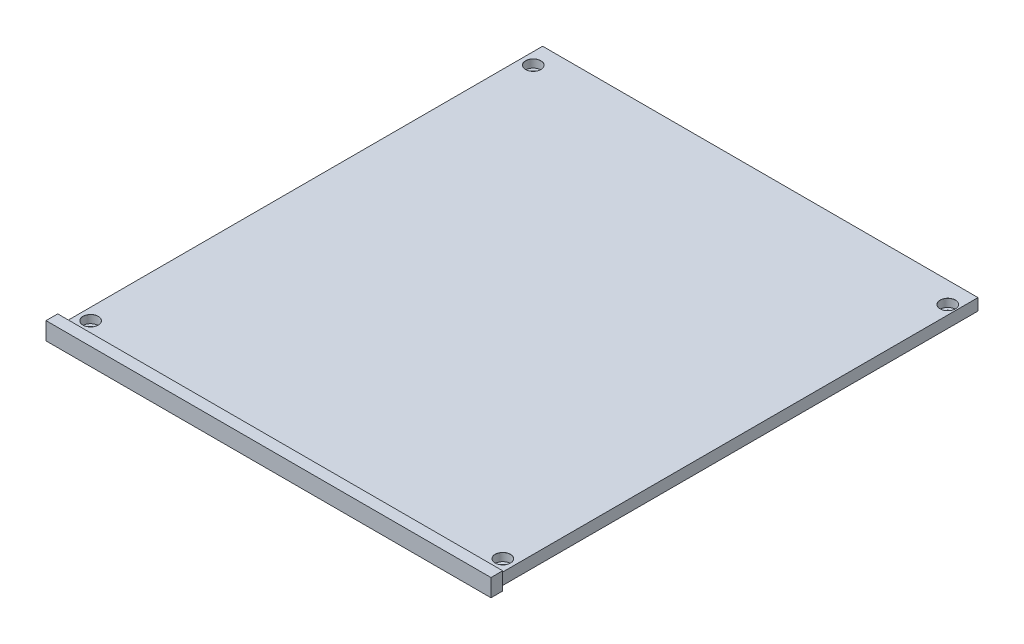
ISO-10303-21;
HEADER;
FILE_DESCRIPTION(('STEP AP214'),'2;1');
FILE_NAME('part.step','',(''),(''),'','','');
FILE_SCHEMA(('AUTOMOTIVE_DESIGN { 1 0 10303 214 1 1 1 1 }'));
ENDSEC;
DATA;
#1=APPLICATION_CONTEXT('core data for automotive mechanical design processes');
#2=APPLICATION_PROTOCOL_DEFINITION('international standard','automotive_design',2000,#1);
#3=PRODUCT_CONTEXT('',#1,'mechanical');
#4=PRODUCT('Part','Part','',(#3));
#5=PRODUCT_RELATED_PRODUCT_CATEGORY('part','',(#4));
#6=PRODUCT_DEFINITION_FORMATION('','',#4);
#7=PRODUCT_DEFINITION_CONTEXT('part definition',#1,'design');
#8=PRODUCT_DEFINITION('design','',#6,#7);
#9=PRODUCT_DEFINITION_SHAPE('','',#8);
#10=(LENGTH_UNIT() NAMED_UNIT(*) SI_UNIT(.MILLI.,.METRE.));
#11=(NAMED_UNIT(*) PLANE_ANGLE_UNIT() SI_UNIT($,.RADIAN.));
#12=(NAMED_UNIT(*) SI_UNIT($,.STERADIAN.) SOLID_ANGLE_UNIT());
#13=UNCERTAINTY_MEASURE_WITH_UNIT(LENGTH_MEASURE(1.E-05),#10,'distance_accuracy_value','');
#14=(GEOMETRIC_REPRESENTATION_CONTEXT(3) GLOBAL_UNCERTAINTY_ASSIGNED_CONTEXT((#13)) GLOBAL_UNIT_ASSIGNED_CONTEXT((#10,
#11,#12)) REPRESENTATION_CONTEXT('',''));
#15=CARTESIAN_POINT('',(0.,0.,0.));
#16=DIRECTION('',(0.,0.,1.));
#17=DIRECTION('',(1.,0.,0.));
#18=AXIS2_PLACEMENT_3D('',#15,#16,#17);
#19=CARTESIAN_POINT('',(0.,0.,0.));
#20=DIRECTION('',(0.,0.,1.));
#21=DIRECTION('',(1.,0.,0.));
#22=AXIS2_PLACEMENT_3D('',#19,#20,#21);
#23=PLANE('',#22);
#24=DIRECTION('',(0.,1.,0.));
#25=VECTOR('',#24,1.);
#26=CARTESIAN_POINT('',(95.,5.,0.));
#27=LINE('',#26,#25);
#28=CARTESIAN_POINT('',(95.,-2.495,0.));
#29=VERTEX_POINT('',#28);
#30=CARTESIAN_POINT('',(95.,5.,0.));
#31=VERTEX_POINT('',#30);
#32=EDGE_CURVE('E144',#29,#31,#27,.T.);
#33=ORIENTED_EDGE('',*,*,#32,.F.);
#34=DIRECTION('',(1.,0.,0.));
#35=VECTOR('',#34,1.);
#36=CARTESIAN_POINT('',(95.,-2.495,0.));
#37=LINE('',#36,#35);
#38=CARTESIAN_POINT('',(92.95,-2.495,0.));
#39=VERTEX_POINT('',#38);
#40=EDGE_CURVE('E130',#39,#29,#37,.T.);
#41=ORIENTED_EDGE('',*,*,#40,.F.);
#42=DIRECTION('',(0.,-1.,0.));
#43=VECTOR('',#42,1.);
#44=CARTESIAN_POINT('',(92.95,2.495,0.));
#45=LINE('',#44,#43);
#46=CARTESIAN_POINT('',(92.95,2.495,0.));
#47=VERTEX_POINT('',#46);
#48=EDGE_CURVE('E236',#47,#39,#45,.T.);
#49=ORIENTED_EDGE('',*,*,#48,.F.);
#50=DIRECTION('',(1.,0.,0.));
#51=VECTOR('',#50,1.);
#52=CARTESIAN_POINT('',(92.95,2.495,0.));
#53=LINE('',#52,#51);
#54=CARTESIAN_POINT('',(-92.95,2.495,0.));
#55=VERTEX_POINT('',#54);
#56=EDGE_CURVE('E70',#55,#47,#53,.T.);
#57=ORIENTED_EDGE('',*,*,#56,.F.);
#58=DIRECTION('',(0.,1.,0.));
#59=VECTOR('',#58,1.);
#60=CARTESIAN_POINT('',(-92.95,2.495,0.));
#61=LINE('',#60,#59);
#62=CARTESIAN_POINT('',(-92.95,-2.495,0.));
#63=VERTEX_POINT('',#62);
#64=EDGE_CURVE('E127',#63,#55,#61,.T.);
#65=ORIENTED_EDGE('',*,*,#64,.F.);
#66=CARTESIAN_POINT('',(-95.,-2.495,0.));
#67=VERTEX_POINT('',#66);
#68=EDGE_CURVE('E63',#67,#63,#37,.T.);
#69=ORIENTED_EDGE('',*,*,#68,.F.);
#70=DIRECTION('',(0.,-1.,0.));
#71=VECTOR('',#70,1.);
#72=CARTESIAN_POINT('',(-95.,5.,0.));
#73=LINE('',#72,#71);
#74=CARTESIAN_POINT('',(-95.,5.,0.));
#75=VERTEX_POINT('',#74);
#76=EDGE_CURVE('E125',#75,#67,#73,.T.);
#77=ORIENTED_EDGE('',*,*,#76,.F.);
#78=DIRECTION('',(-1.,0.,0.));
#79=VECTOR('',#78,1.);
#80=CARTESIAN_POINT('',(-95.,5.,0.));
#81=LINE('',#80,#79);
#82=EDGE_CURVE('E138',#31,#75,#81,.T.);
#83=ORIENTED_EDGE('',*,*,#82,.F.);
#84=EDGE_LOOP('',(#33,#41,#49,#57,#65,#69,#77,#83));
#85=FACE_BOUND('',#84,.T.);
#86=ADVANCED_FACE('F47',(#85),#23,.F.);
#87=CARTESIAN_POINT('',(95.,5.,5.));
#88=DIRECTION('',(-1.,0.,0.));
#89=DIRECTION('',(0.,0.,1.));
#90=AXIS2_PLACEMENT_3D('',#87,#88,#89);
#91=PLANE('',#90);
#92=DIRECTION('',(0.,1.,0.));
#93=VECTOR('',#92,1.);
#94=CARTESIAN_POINT('',(95.,5.,5.));
#95=LINE('',#94,#93);
#96=CARTESIAN_POINT('',(95.,-2.495,5.));
#97=VERTEX_POINT('',#96);
#98=CARTESIAN_POINT('',(95.,5.,5.));
#99=VERTEX_POINT('',#98);
#100=EDGE_CURVE('E137',#97,#99,#95,.T.);
#101=ORIENTED_EDGE('',*,*,#100,.F.);
#102=DIRECTION('',(0.,0.,-1.));
#103=VECTOR('',#102,1.);
#104=CARTESIAN_POINT('',(95.,-2.495,10.));
#105=LINE('',#104,#103);
#106=EDGE_CURVE('E120',#97,#29,#105,.T.);
#107=ORIENTED_EDGE('',*,*,#106,.T.);
#108=ORIENTED_EDGE('',*,*,#32,.T.);
#109=DIRECTION('',(0.,0.,-1.));
#110=VECTOR('',#109,1.);
#111=CARTESIAN_POINT('',(95.,5.,5.));
#112=LINE('',#111,#110);
#113=EDGE_CURVE('E56',#99,#31,#112,.T.);
#114=ORIENTED_EDGE('',*,*,#113,.F.);
#115=EDGE_LOOP('',(#101,#107,#108,#114));
#116=FACE_BOUND('',#115,.T.);
#117=ADVANCED_FACE('F49',(#116),#91,.F.);
#118=CARTESIAN_POINT('',(-95.,5.,5.));
#119=DIRECTION('',(0.,-1.,0.));
#120=DIRECTION('',(0.,0.,-1.));
#121=AXIS2_PLACEMENT_3D('',#118,#119,#120);
#122=PLANE('',#121);
#123=ORIENTED_EDGE('',*,*,#82,.T.);
#124=DIRECTION('',(0.,0.,-1.));
#125=VECTOR('',#124,1.);
#126=CARTESIAN_POINT('',(-95.,5.,5.));
#127=LINE('',#126,#125);
#128=CARTESIAN_POINT('',(-95.,5.,5.));
#129=VERTEX_POINT('',#128);
#130=EDGE_CURVE('E135',#129,#75,#127,.T.);
#131=ORIENTED_EDGE('',*,*,#130,.F.);
#132=DIRECTION('',(-1.,0.,0.));
#133=VECTOR('',#132,1.);
#134=CARTESIAN_POINT('',(-95.,5.,5.));
#135=LINE('',#134,#133);
#136=EDGE_CURVE('E142',#99,#129,#135,.T.);
#137=ORIENTED_EDGE('',*,*,#136,.F.);
#138=ORIENTED_EDGE('',*,*,#113,.T.);
#139=EDGE_LOOP('',(#123,#131,#137,#138));
#140=FACE_BOUND('',#139,.T.);
#141=ADVANCED_FACE('F275',(#140),#122,.F.);
#142=CARTESIAN_POINT('',(-95.,5.,5.));
#143=DIRECTION('',(1.,0.,0.));
#144=DIRECTION('',(0.,0.,-1.));
#145=AXIS2_PLACEMENT_3D('',#142,#143,#144);
#146=PLANE('',#145);
#147=ORIENTED_EDGE('',*,*,#76,.T.);
#148=DIRECTION('',(0.,0.,-1.));
#149=VECTOR('',#148,1.);
#150=CARTESIAN_POINT('',(-95.,-2.495,10.));
#151=LINE('',#150,#149);
#152=CARTESIAN_POINT('',(-95.,-2.495,5.));
#153=VERTEX_POINT('',#152);
#154=EDGE_CURVE('E111',#153,#67,#151,.T.);
#155=ORIENTED_EDGE('',*,*,#154,.F.);
#156=DIRECTION('',(0.,-1.,0.));
#157=VECTOR('',#156,1.);
#158=CARTESIAN_POINT('',(-95.,5.,5.));
#159=LINE('',#158,#157);
#160=EDGE_CURVE('E150',#129,#153,#159,.T.);
#161=ORIENTED_EDGE('',*,*,#160,.F.);
#162=ORIENTED_EDGE('',*,*,#130,.T.);
#163=EDGE_LOOP('',(#147,#155,#161,#162));
#164=FACE_BOUND('',#163,.T.);
#165=ADVANCED_FACE('F133',(#164),#146,.F.);
#166=CARTESIAN_POINT('',(0.,0.,5.));
#167=DIRECTION('',(0.,0.,1.));
#168=DIRECTION('',(1.,0.,0.));
#169=AXIS2_PLACEMENT_3D('',#166,#167,#168);
#170=PLANE('',#169);
#171=DIRECTION('',(-1.,0.,0.));
#172=VECTOR('',#171,1.);
#173=CARTESIAN_POINT('',(0.,-2.495,5.));
#174=LINE('',#173,#172);
#175=EDGE_CURVE('E11',#97,#153,#174,.T.);
#176=ORIENTED_EDGE('',*,*,#175,.F.);
#177=ORIENTED_EDGE('',*,*,#100,.T.);
#178=ORIENTED_EDGE('',*,*,#136,.T.);
#179=ORIENTED_EDGE('',*,*,#160,.T.);
#180=EDGE_LOOP('',(#176,#177,#178,#179));
#181=FACE_BOUND('',#180,.T.);
#182=ADVANCED_FACE('F277',(#181),#170,.T.);
#183=CARTESIAN_POINT('',(-92.95,2.495,-205.));
#184=DIRECTION('',(1.,0.,0.));
#185=DIRECTION('',(0.,0.,-1.));
#186=AXIS2_PLACEMENT_3D('',#183,#184,#185);
#187=PLANE('',#186);
#188=ORIENTED_EDGE('',*,*,#64,.T.);
#189=DIRECTION('',(0.,0.,1.));
#190=VECTOR('',#189,1.);
#191=CARTESIAN_POINT('',(-92.95,2.495,-205.));
#192=LINE('',#191,#190);
#193=CARTESIAN_POINT('',(-92.95,2.495,-205.));
#194=VERTEX_POINT('',#193);
#195=EDGE_CURVE('E262',#194,#55,#192,.T.);
#196=ORIENTED_EDGE('',*,*,#195,.F.);
#197=DIRECTION('',(0.,1.,0.));
#198=VECTOR('',#197,1.);
#199=CARTESIAN_POINT('',(-92.95,2.495,-205.));
#200=LINE('',#199,#198);
#201=CARTESIAN_POINT('',(-92.95,-2.495,-205.));
#202=VERTEX_POINT('',#201);
#203=EDGE_CURVE('E231',#202,#194,#200,.T.);
#204=ORIENTED_EDGE('',*,*,#203,.F.);
#205=DIRECTION('',(0.,0.,1.));
#206=VECTOR('',#205,1.);
#207=CARTESIAN_POINT('',(-92.95,-2.495,-205.));
#208=LINE('',#207,#206);
#209=EDGE_CURVE('E245',#202,#63,#208,.T.);
#210=ORIENTED_EDGE('',*,*,#209,.T.);
#211=EDGE_LOOP('',(#188,#196,#204,#210));
#212=FACE_BOUND('',#211,.T.);
#213=ADVANCED_FACE('F279',(#212),#187,.F.);
#214=CARTESIAN_POINT('',(92.95,2.495,-205.));
#215=DIRECTION('',(0.,-1.,0.));
#216=DIRECTION('',(0.,0.,-1.));
#217=AXIS2_PLACEMENT_3D('',#214,#215,#216);
#218=PLANE('',#217);
#219=CARTESIAN_POINT('',(-87.95,2.495,-6.9999999999999));
#220=DIRECTION('',(0.,1.,0.));
#221=DIRECTION('',(0.,0.,1.));
#222=AXIS2_PLACEMENT_3D('',#219,#220,#221);
#223=CIRCLE('',#222,3.275);
#224=CARTESIAN_POINT('',(-87.95,2.495,-3.72499999999989));
#225=VERTEX_POINT('',#224);
#226=EDGE_CURVE('E536',#225,#225,#223,.T.);
#227=ORIENTED_EDGE('',*,*,#226,.F.);
#228=EDGE_LOOP('',(#227));
#229=FACE_BOUND('',#228,.T.);
#230=CARTESIAN_POINT('',(88.05,2.495,-6.99999999999984));
#231=DIRECTION('',(0.,1.,0.));
#232=DIRECTION('',(0.,0.,1.));
#233=AXIS2_PLACEMENT_3D('',#230,#231,#232);
#234=CIRCLE('',#233,3.275);
#235=CARTESIAN_POINT('',(88.05,2.495,-3.72499999999984));
#236=VERTEX_POINT('',#235);
#237=EDGE_CURVE('E173',#236,#236,#234,.T.);
#238=ORIENTED_EDGE('',*,*,#237,.F.);
#239=EDGE_LOOP('',(#238));
#240=FACE_BOUND('',#239,.T.);
#241=CARTESIAN_POINT('',(89.0500000000005,2.495,-196.));
#242=DIRECTION('',(0.,1.,0.));
#243=DIRECTION('',(0.,0.,1.));
#244=AXIS2_PLACEMENT_3D('',#241,#242,#243);
#245=CIRCLE('',#244,3.275);
#246=CARTESIAN_POINT('',(89.0500000000005,2.495,-192.725));
#247=VERTEX_POINT('',#246);
#248=EDGE_CURVE('E168',#247,#247,#245,.T.);
#249=ORIENTED_EDGE('',*,*,#248,.F.);
#250=EDGE_LOOP('',(#249));
#251=FACE_BOUND('',#250,.T.);
#252=CARTESIAN_POINT('',(-87.9499999999999,2.495,-196.));
#253=DIRECTION('',(0.,1.,0.));
#254=DIRECTION('',(0.,0.,1.));
#255=AXIS2_PLACEMENT_3D('',#252,#253,#254);
#256=CIRCLE('',#255,3.275);
#257=CARTESIAN_POINT('',(-87.9499999999999,2.495,-192.725));
#258=VERTEX_POINT('',#257);
#259=EDGE_CURVE('E163',#258,#258,#256,.T.);
#260=ORIENTED_EDGE('',*,*,#259,.F.);
#261=EDGE_LOOP('',(#260));
#262=FACE_BOUND('',#261,.T.);
#263=ORIENTED_EDGE('',*,*,#56,.T.);
#264=DIRECTION('',(0.,0.,1.));
#265=VECTOR('',#264,1.);
#266=CARTESIAN_POINT('',(92.95,2.495,-205.));
#267=LINE('',#266,#265);
#268=CARTESIAN_POINT('',(92.95,2.495,-205.));
#269=VERTEX_POINT('',#268);
#270=EDGE_CURVE('E258',#269,#47,#267,.T.);
#271=ORIENTED_EDGE('',*,*,#270,.F.);
#272=DIRECTION('',(1.,0.,0.));
#273=VECTOR('',#272,1.);
#274=CARTESIAN_POINT('',(92.95,2.495,-205.));
#275=LINE('',#274,#273);
#276=EDGE_CURVE('E235',#194,#269,#275,.T.);
#277=ORIENTED_EDGE('',*,*,#276,.F.);
#278=ORIENTED_EDGE('',*,*,#195,.T.);
#279=EDGE_LOOP('',(#263,#271,#277,#278));
#280=FACE_BOUND('',#279,.T.);
#281=ADVANCED_FACE('F285',(#229,#240,#251,#262,#280),#218,.F.);
#282=CARTESIAN_POINT('',(92.95,2.495,-205.));
#283=DIRECTION('',(-1.,0.,0.));
#284=DIRECTION('',(0.,0.,1.));
#285=AXIS2_PLACEMENT_3D('',#282,#283,#284);
#286=PLANE('',#285);
#287=ORIENTED_EDGE('',*,*,#48,.T.);
#288=DIRECTION('',(0.,0.,1.));
#289=VECTOR('',#288,1.);
#290=CARTESIAN_POINT('',(92.95,-2.495,-205.));
#291=LINE('',#290,#289);
#292=CARTESIAN_POINT('',(92.95,-2.495,-205.));
#293=VERTEX_POINT('',#292);
#294=EDGE_CURVE('E255',#293,#39,#291,.T.);
#295=ORIENTED_EDGE('',*,*,#294,.F.);
#296=DIRECTION('',(0.,-1.,0.));
#297=VECTOR('',#296,1.);
#298=CARTESIAN_POINT('',(92.95,2.495,-205.));
#299=LINE('',#298,#297);
#300=EDGE_CURVE('E239',#269,#293,#299,.T.);
#301=ORIENTED_EDGE('',*,*,#300,.F.);
#302=ORIENTED_EDGE('',*,*,#270,.T.);
#303=EDGE_LOOP('',(#287,#295,#301,#302));
#304=FACE_BOUND('',#303,.T.);
#305=ADVANCED_FACE('F319',(#304),#286,.F.);
#306=CARTESIAN_POINT('',(92.95,-2.495,-205.));
#307=DIRECTION('',(0.,1.,0.));
#308=DIRECTION('',(0.,0.,1.));
#309=AXIS2_PLACEMENT_3D('',#306,#307,#308);
#310=PLANE('',#309);
#311=CARTESIAN_POINT('',(-87.95,-2.495,-6.9999999999999));
#312=DIRECTION('',(0.,1.,0.));
#313=DIRECTION('',(0.,0.,1.));
#314=AXIS2_PLACEMENT_3D('',#311,#312,#313);
#315=CIRCLE('',#314,1.8);
#316=CARTESIAN_POINT('',(-87.95,-2.495,-5.1999999999999));
#317=VERTEX_POINT('',#316);
#318=EDGE_CURVE('E170',#317,#317,#315,.T.);
#319=ORIENTED_EDGE('',*,*,#318,.T.);
#320=EDGE_LOOP('',(#319));
#321=FACE_BOUND('',#320,.T.);
#322=CARTESIAN_POINT('',(88.05,-2.495,-6.99999999999984));
#323=DIRECTION('',(0.,1.,0.));
#324=DIRECTION('',(0.,0.,1.));
#325=AXIS2_PLACEMENT_3D('',#322,#323,#324);
#326=CIRCLE('',#325,1.8);
#327=CARTESIAN_POINT('',(88.05,-2.495,-5.19999999999984));
#328=VERTEX_POINT('',#327);
#329=EDGE_CURVE('E165',#328,#328,#326,.T.);
#330=ORIENTED_EDGE('',*,*,#329,.T.);
#331=EDGE_LOOP('',(#330));
#332=FACE_BOUND('',#331,.T.);
#333=CARTESIAN_POINT('',(89.0500000000005,-2.495,-196.));
#334=DIRECTION('',(0.,1.,0.));
#335=DIRECTION('',(0.,0.,1.));
#336=AXIS2_PLACEMENT_3D('',#333,#334,#335);
#337=CIRCLE('',#336,1.8);
#338=CARTESIAN_POINT('',(89.0500000000005,-2.495,-194.2));
#339=VERTEX_POINT('',#338);
#340=EDGE_CURVE('E159',#339,#339,#337,.T.);
#341=ORIENTED_EDGE('',*,*,#340,.T.);
#342=EDGE_LOOP('',(#341));
#343=FACE_BOUND('',#342,.T.);
#344=CARTESIAN_POINT('',(-87.9499999999999,-2.495,-196.));
#345=DIRECTION('',(0.,1.,0.));
#346=DIRECTION('',(0.,0.,1.));
#347=AXIS2_PLACEMENT_3D('',#344,#345,#346);
#348=CIRCLE('',#347,1.8);
#349=CARTESIAN_POINT('',(-87.9499999999999,-2.495,-194.2));
#350=VERTEX_POINT('',#349);
#351=EDGE_CURVE('E154',#350,#350,#348,.T.);
#352=ORIENTED_EDGE('',*,*,#351,.T.);
#353=EDGE_LOOP('',(#352));
#354=FACE_BOUND('',#353,.T.);
#355=ORIENTED_EDGE('',*,*,#294,.T.);
#356=ORIENTED_EDGE('',*,*,#40,.T.);
#357=ORIENTED_EDGE('',*,*,#106,.F.);
#358=ORIENTED_EDGE('',*,*,#175,.T.);
#359=ORIENTED_EDGE('',*,*,#154,.T.);
#360=ORIENTED_EDGE('',*,*,#68,.T.);
#361=ORIENTED_EDGE('',*,*,#209,.F.);
#362=DIRECTION('',(-1.,0.,0.));
#363=VECTOR('',#362,1.);
#364=CARTESIAN_POINT('',(92.95,-2.495,-205.));
#365=LINE('',#364,#363);
#366=EDGE_CURVE('E242',#293,#202,#365,.T.);
#367=ORIENTED_EDGE('',*,*,#366,.F.);
#368=EDGE_LOOP('',(#355,#356,#357,#358,#359,#360,#361,#367));
#369=FACE_BOUND('',#368,.T.);
#370=ADVANCED_FACE('F113',(#321,#332,#343,#354,#369),#310,.F.);
#371=CARTESIAN_POINT('',(0.,0.,-205.));
#372=DIRECTION('',(0.,0.,-1.));
#373=DIRECTION('',(-1.,0.,0.));
#374=AXIS2_PLACEMENT_3D('',#371,#372,#373);
#375=PLANE('',#374);
#376=ORIENTED_EDGE('',*,*,#203,.T.);
#377=ORIENTED_EDGE('',*,*,#276,.T.);
#378=ORIENTED_EDGE('',*,*,#300,.T.);
#379=ORIENTED_EDGE('',*,*,#366,.T.);
#380=EDGE_LOOP('',(#376,#377,#378,#379));
#381=FACE_BOUND('',#380,.T.);
#382=ADVANCED_FACE('F304',(#381),#375,.T.);
#383=CARTESIAN_POINT('',(-87.9499999999999,2.495,-196.));
#384=DIRECTION('',(0.,1.,0.));
#385=DIRECTION('',(0.,0.,1.));
#386=AXIS2_PLACEMENT_3D('',#383,#384,#385);
#387=CYLINDRICAL_SURFACE('',#386,1.8);
#388=CARTESIAN_POINT('',(-87.9499999999999,-0.904999999999996,-196.));
#389=DIRECTION('',(0.,1.,0.));
#390=DIRECTION('',(0.,0.,1.));
#391=AXIS2_PLACEMENT_3D('',#388,#389,#390);
#392=CIRCLE('',#391,1.8);
#393=CARTESIAN_POINT('',(-87.9499999999999,-0.904999999999996,-194.2));
#394=VERTEX_POINT('',#393);
#395=EDGE_CURVE('E158',#394,#394,#392,.T.);
#396=ORIENTED_EDGE('',*,*,#395,.T.);
#397=EDGE_LOOP('',(#396));
#398=FACE_BOUND('',#397,.T.);
#399=ORIENTED_EDGE('',*,*,#351,.F.);
#400=EDGE_LOOP('',(#399));
#401=FACE_BOUND('',#400,.T.);
#402=ADVANCED_FACE('F308',(#398,#401),#387,.F.);
#403=CARTESIAN_POINT('',(-86.1499999999999,-0.904999999999996,-196.));
#404=DIRECTION('',(0.,-1.,0.));
#405=DIRECTION('',(0.,0.,-1.));
#406=AXIS2_PLACEMENT_3D('',#403,#404,#405);
#407=PLANE('',#406);
#408=ORIENTED_EDGE('',*,*,#395,.F.);
#409=EDGE_LOOP('',(#408));
#410=FACE_BOUND('',#409,.T.);
#411=CARTESIAN_POINT('',(-87.9499999999999,-0.904999999999996,-196.));
#412=DIRECTION('',(0.,1.,0.));
#413=DIRECTION('',(0.,0.,1.));
#414=AXIS2_PLACEMENT_3D('',#411,#412,#413);
#415=CIRCLE('',#414,3.24999999999999);
#416=CARTESIAN_POINT('',(-87.9499999999999,-0.904999999999996,-192.75));
#417=VERTEX_POINT('',#416);
#418=EDGE_CURVE('E224',#417,#417,#415,.T.);
#419=ORIENTED_EDGE('',*,*,#418,.T.);
#420=EDGE_LOOP('',(#419));
#421=FACE_BOUND('',#420,.T.);
#422=ADVANCED_FACE('F329',(#410,#421),#407,.F.);
#423=CARTESIAN_POINT('',(-87.9499999999999,2.495,-196.));
#424=DIRECTION('',(0.,1.,0.));
#425=DIRECTION('',(0.,0.,1.));
#426=AXIS2_PLACEMENT_3D('',#423,#424,#425);
#427=CYLINDRICAL_SURFACE('',#426,3.25);
#428=ORIENTED_EDGE('',*,*,#418,.F.);
#429=EDGE_LOOP('',(#428));
#430=FACE_BOUND('',#429,.T.);
#431=CARTESIAN_POINT('',(-87.9499999999999,2.47,-196.));
#432=DIRECTION('',(0.,1.,0.));
#433=DIRECTION('',(0.,0.,1.));
#434=AXIS2_PLACEMENT_3D('',#431,#432,#433);
#435=CIRCLE('',#434,3.25);
#436=CARTESIAN_POINT('',(-87.9499999999999,2.47,-192.75));
#437=VERTEX_POINT('',#436);
#438=EDGE_CURVE('E220',#437,#437,#435,.T.);
#439=ORIENTED_EDGE('',*,*,#438,.T.);
#440=EDGE_LOOP('',(#439));
#441=FACE_BOUND('',#440,.T.);
#442=ADVANCED_FACE('F338',(#430,#441),#427,.F.);
#443=CARTESIAN_POINT('',(-87.9499999999999,2.495,-196.));
#444=DIRECTION('',(0.,1.,0.));
#445=DIRECTION('',(0.,0.,1.));
#446=AXIS2_PLACEMENT_3D('',#443,#444,#445);
#447=CONICAL_SURFACE('',#446,3.275,0.785398163397318);
#448=ORIENTED_EDGE('',*,*,#438,.F.);
#449=EDGE_LOOP('',(#448));
#450=FACE_BOUND('',#449,.T.);
#451=ORIENTED_EDGE('',*,*,#259,.T.);
#452=EDGE_LOOP('',(#451));
#453=FACE_BOUND('',#452,.T.);
#454=ADVANCED_FACE('F347',(#450,#453),#447,.F.);
#455=CARTESIAN_POINT('',(89.0500000000005,2.495,-196.));
#456=DIRECTION('',(0.,1.,0.));
#457=DIRECTION('',(0.,0.,1.));
#458=AXIS2_PLACEMENT_3D('',#455,#456,#457);
#459=CYLINDRICAL_SURFACE('',#458,1.8);
#460=CARTESIAN_POINT('',(89.0500000000005,-0.904999999999996,-196.));
#461=DIRECTION('',(0.,1.,0.));
#462=DIRECTION('',(0.,0.,1.));
#463=AXIS2_PLACEMENT_3D('',#460,#461,#462);
#464=CIRCLE('',#463,1.8);
#465=CARTESIAN_POINT('',(89.0500000000005,-0.904999999999996,-194.2));
#466=VERTEX_POINT('',#465);
#467=EDGE_CURVE('E164',#466,#466,#464,.T.);
#468=ORIENTED_EDGE('',*,*,#467,.T.);
#469=EDGE_LOOP('',(#468));
#470=FACE_BOUND('',#469,.T.);
#471=ORIENTED_EDGE('',*,*,#340,.F.);
#472=EDGE_LOOP('',(#471));
#473=FACE_BOUND('',#472,.T.);
#474=ADVANCED_FACE('F356',(#470,#473),#459,.F.);
#475=CARTESIAN_POINT('',(90.8500000000004,-0.904999999999996,-196.));
#476=DIRECTION('',(0.,-1.,0.));
#477=DIRECTION('',(0.,0.,-1.));
#478=AXIS2_PLACEMENT_3D('',#475,#476,#477);
#479=PLANE('',#478);
#480=ORIENTED_EDGE('',*,*,#467,.F.);
#481=EDGE_LOOP('',(#480));
#482=FACE_BOUND('',#481,.T.);
#483=CARTESIAN_POINT('',(89.0500000000005,-0.904999999999996,-196.));
#484=DIRECTION('',(0.,1.,0.));
#485=DIRECTION('',(0.,0.,1.));
#486=AXIS2_PLACEMENT_3D('',#483,#484,#485);
#487=CIRCLE('',#486,3.24999999999999);
#488=CARTESIAN_POINT('',(89.0500000000005,-0.904999999999996,-192.75));
#489=VERTEX_POINT('',#488);
#490=EDGE_CURVE('E210',#489,#489,#487,.T.);
#491=ORIENTED_EDGE('',*,*,#490,.T.);
#492=EDGE_LOOP('',(#491));
#493=FACE_BOUND('',#492,.T.);
#494=ADVANCED_FACE('F365',(#482,#493),#479,.F.);
#495=CARTESIAN_POINT('',(89.0500000000005,2.495,-196.));
#496=DIRECTION('',(0.,1.,0.));
#497=DIRECTION('',(0.,0.,1.));
#498=AXIS2_PLACEMENT_3D('',#495,#496,#497);
#499=CYLINDRICAL_SURFACE('',#498,3.25);
#500=ORIENTED_EDGE('',*,*,#490,.F.);
#501=EDGE_LOOP('',(#500));
#502=FACE_BOUND('',#501,.T.);
#503=CARTESIAN_POINT('',(89.0500000000005,2.47,-196.));
#504=DIRECTION('',(0.,1.,0.));
#505=DIRECTION('',(0.,0.,1.));
#506=AXIS2_PLACEMENT_3D('',#503,#504,#505);
#507=CIRCLE('',#506,3.25);
#508=CARTESIAN_POINT('',(89.0500000000005,2.47,-192.75));
#509=VERTEX_POINT('',#508);
#510=EDGE_CURVE('E206',#509,#509,#507,.T.);
#511=ORIENTED_EDGE('',*,*,#510,.T.);
#512=EDGE_LOOP('',(#511));
#513=FACE_BOUND('',#512,.T.);
#514=ADVANCED_FACE('F374',(#502,#513),#499,.F.);
#515=CARTESIAN_POINT('',(89.0500000000005,2.495,-196.));
#516=DIRECTION('',(0.,1.,0.));
#517=DIRECTION('',(0.,0.,1.));
#518=AXIS2_PLACEMENT_3D('',#515,#516,#517);
#519=CONICAL_SURFACE('',#518,3.275,0.785398163397318);
#520=ORIENTED_EDGE('',*,*,#510,.F.);
#521=EDGE_LOOP('',(#520));
#522=FACE_BOUND('',#521,.T.);
#523=ORIENTED_EDGE('',*,*,#248,.T.);
#524=EDGE_LOOP('',(#523));
#525=FACE_BOUND('',#524,.T.);
#526=ADVANCED_FACE('F383',(#522,#525),#519,.F.);
#527=CARTESIAN_POINT('',(88.05,2.495,-6.99999999999984));
#528=DIRECTION('',(0.,1.,0.));
#529=DIRECTION('',(0.,0.,1.));
#530=AXIS2_PLACEMENT_3D('',#527,#528,#529);
#531=CYLINDRICAL_SURFACE('',#530,1.8);
#532=CARTESIAN_POINT('',(88.05,-0.904999999999996,-6.99999999999984));
#533=DIRECTION('',(0.,1.,0.));
#534=DIRECTION('',(0.,0.,1.));
#535=AXIS2_PLACEMENT_3D('',#532,#533,#534);
#536=CIRCLE('',#535,1.8);
#537=CARTESIAN_POINT('',(88.05,-0.904999999999996,-5.19999999999984));
#538=VERTEX_POINT('',#537);
#539=EDGE_CURVE('E169',#538,#538,#536,.T.);
#540=ORIENTED_EDGE('',*,*,#539,.T.);
#541=EDGE_LOOP('',(#540));
#542=FACE_BOUND('',#541,.T.);
#543=ORIENTED_EDGE('',*,*,#329,.F.);
#544=EDGE_LOOP('',(#543));
#545=FACE_BOUND('',#544,.T.);
#546=ADVANCED_FACE('F392',(#542,#545),#531,.F.);
#547=CARTESIAN_POINT('',(89.85,-0.904999999999996,-6.99999999999984));
#548=DIRECTION('',(0.,-1.,0.));
#549=DIRECTION('',(0.,0.,-1.));
#550=AXIS2_PLACEMENT_3D('',#547,#548,#549);
#551=PLANE('',#550);
#552=ORIENTED_EDGE('',*,*,#539,.F.);
#553=EDGE_LOOP('',(#552));
#554=FACE_BOUND('',#553,.T.);
#555=CARTESIAN_POINT('',(88.05,-0.904999999999996,-6.99999999999984));
#556=DIRECTION('',(0.,1.,0.));
#557=DIRECTION('',(0.,0.,1.));
#558=AXIS2_PLACEMENT_3D('',#555,#556,#557);
#559=CIRCLE('',#558,3.25);
#560=CARTESIAN_POINT('',(88.05,-0.904999999999996,-3.74999999999984));
#561=VERTEX_POINT('',#560);
#562=EDGE_CURVE('E196',#561,#561,#559,.T.);
#563=ORIENTED_EDGE('',*,*,#562,.T.);
#564=EDGE_LOOP('',(#563));
#565=FACE_BOUND('',#564,.T.);
#566=ADVANCED_FACE('F401',(#554,#565),#551,.F.);
#567=CARTESIAN_POINT('',(88.05,2.495,-6.99999999999984));
#568=DIRECTION('',(0.,1.,0.));
#569=DIRECTION('',(0.,0.,1.));
#570=AXIS2_PLACEMENT_3D('',#567,#568,#569);
#571=CYLINDRICAL_SURFACE('',#570,3.25);
#572=ORIENTED_EDGE('',*,*,#562,.F.);
#573=EDGE_LOOP('',(#572));
#574=FACE_BOUND('',#573,.T.);
#575=CARTESIAN_POINT('',(88.05,2.47,-6.99999999999984));
#576=DIRECTION('',(0.,1.,0.));
#577=DIRECTION('',(0.,0.,1.));
#578=AXIS2_PLACEMENT_3D('',#575,#576,#577);
#579=CIRCLE('',#578,3.25);
#580=CARTESIAN_POINT('',(88.05,2.47,-3.74999999999984));
#581=VERTEX_POINT('',#580);
#582=EDGE_CURVE('E180',#581,#581,#579,.T.);
#583=ORIENTED_EDGE('',*,*,#582,.T.);
#584=EDGE_LOOP('',(#583));
#585=FACE_BOUND('',#584,.T.);
#586=ADVANCED_FACE('F410',(#574,#585),#571,.F.);
#587=CARTESIAN_POINT('',(88.05,2.495,-6.99999999999984));
#588=DIRECTION('',(0.,1.,0.));
#589=DIRECTION('',(0.,0.,1.));
#590=AXIS2_PLACEMENT_3D('',#587,#588,#589);
#591=CONICAL_SURFACE('',#590,3.275,0.785398163397318);
#592=ORIENTED_EDGE('',*,*,#582,.F.);
#593=EDGE_LOOP('',(#592));
#594=FACE_BOUND('',#593,.T.);
#595=ORIENTED_EDGE('',*,*,#237,.T.);
#596=EDGE_LOOP('',(#595));
#597=FACE_BOUND('',#596,.T.);
#598=ADVANCED_FACE('F419',(#594,#597),#591,.F.);
#599=CARTESIAN_POINT('',(-87.95,2.495,-6.9999999999999));
#600=DIRECTION('',(0.,1.,0.));
#601=DIRECTION('',(0.,0.,1.));
#602=AXIS2_PLACEMENT_3D('',#599,#600,#601);
#603=CYLINDRICAL_SURFACE('',#602,1.8);
#604=CARTESIAN_POINT('',(-87.95,-0.904999999999996,-6.9999999999999));
#605=DIRECTION('',(0.,1.,0.));
#606=DIRECTION('',(0.,0.,1.));
#607=AXIS2_PLACEMENT_3D('',#604,#605,#606);
#608=CIRCLE('',#607,1.8);
#609=CARTESIAN_POINT('',(-87.95,-0.904999999999996,-5.1999999999999));
#610=VERTEX_POINT('',#609);
#611=EDGE_CURVE('E174',#610,#610,#608,.T.);
#612=ORIENTED_EDGE('',*,*,#611,.T.);
#613=EDGE_LOOP('',(#612));
#614=FACE_BOUND('',#613,.T.);
#615=ORIENTED_EDGE('',*,*,#318,.F.);
#616=EDGE_LOOP('',(#615));
#617=FACE_BOUND('',#616,.T.);
#618=ADVANCED_FACE('F428',(#614,#617),#603,.F.);
#619=CARTESIAN_POINT('',(-86.15,-0.904999999999996,-6.9999999999999));
#620=DIRECTION('',(0.,-1.,0.));
#621=DIRECTION('',(0.,0.,-1.));
#622=AXIS2_PLACEMENT_3D('',#619,#620,#621);
#623=PLANE('',#622);
#624=ORIENTED_EDGE('',*,*,#611,.F.);
#625=EDGE_LOOP('',(#624));
#626=FACE_BOUND('',#625,.T.);
#627=CARTESIAN_POINT('',(-87.95,-0.904999999999996,-6.9999999999999));
#628=DIRECTION('',(0.,1.,0.));
#629=DIRECTION('',(0.,0.,1.));
#630=AXIS2_PLACEMENT_3D('',#627,#628,#629);
#631=CIRCLE('',#630,3.25);
#632=CARTESIAN_POINT('',(-87.95,-0.904999999999996,-3.74999999999989));
#633=VERTEX_POINT('',#632);
#634=EDGE_CURVE('E183',#633,#633,#631,.T.);
#635=ORIENTED_EDGE('',*,*,#634,.T.);
#636=EDGE_LOOP('',(#635));
#637=FACE_BOUND('',#636,.T.);
#638=ADVANCED_FACE('F437',(#626,#637),#623,.F.);
#639=CARTESIAN_POINT('',(-87.95,2.495,-6.9999999999999));
#640=DIRECTION('',(0.,1.,0.));
#641=DIRECTION('',(0.,0.,1.));
#642=AXIS2_PLACEMENT_3D('',#639,#640,#641);
#643=CYLINDRICAL_SURFACE('',#642,3.25);
#644=ORIENTED_EDGE('',*,*,#634,.F.);
#645=EDGE_LOOP('',(#644));
#646=FACE_BOUND('',#645,.T.);
#647=CARTESIAN_POINT('',(-87.95,2.47,-6.9999999999999));
#648=DIRECTION('',(0.,1.,0.));
#649=DIRECTION('',(0.,0.,1.));
#650=AXIS2_PLACEMENT_3D('',#647,#648,#649);
#651=CIRCLE('',#650,3.25);
#652=CARTESIAN_POINT('',(-87.95,2.47,-3.74999999999989));
#653=VERTEX_POINT('',#652);
#654=EDGE_CURVE('E189',#653,#653,#651,.T.);
#655=ORIENTED_EDGE('',*,*,#654,.T.);
#656=EDGE_LOOP('',(#655));
#657=FACE_BOUND('',#656,.T.);
#658=ADVANCED_FACE('F445',(#646,#657),#643,.F.);
#659=CARTESIAN_POINT('',(-87.95,2.495,-6.9999999999999));
#660=DIRECTION('',(0.,1.,0.));
#661=DIRECTION('',(0.,0.,1.));
#662=AXIS2_PLACEMENT_3D('',#659,#660,#661);
#663=CONICAL_SURFACE('',#662,3.275,0.785398163397318);
#664=ORIENTED_EDGE('',*,*,#654,.F.);
#665=EDGE_LOOP('',(#664));
#666=FACE_BOUND('',#665,.T.);
#667=ORIENTED_EDGE('',*,*,#226,.T.);
#668=EDGE_LOOP('',(#667));
#669=FACE_BOUND('',#668,.T.);
#670=ADVANCED_FACE('F453',(#666,#669),#663,.F.);
#671=CLOSED_SHELL('',(#86,#117,#141,#165,#182,#213,#281,#305,#370,#382,#402,#422,#442,#454,#474,
#494,#514,#526,#546,#566,#586,#598,#618,#638,#658,#670));
#672=MANIFOLD_SOLID_BREP('B2',#671);
#673=ADVANCED_BREP_SHAPE_REPRESENTATION('',(#18,#672),#14);
#674=SHAPE_DEFINITION_REPRESENTATION(#9,#673);
ENDSEC;
END-ISO-10303-21;
